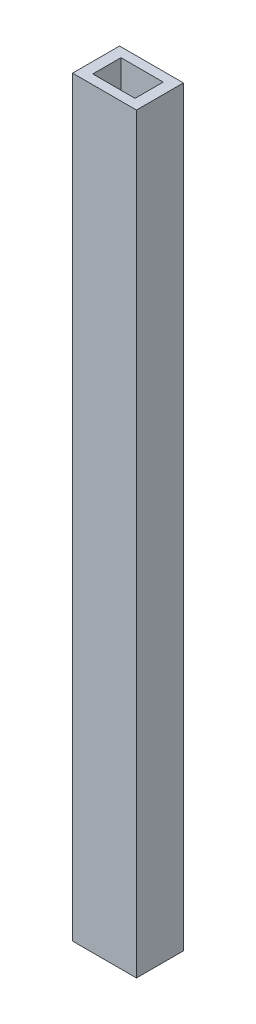
ISO-10303-21;
HEADER;
FILE_DESCRIPTION(('STEP AP214'),'2;1');
FILE_NAME('part.step','',(''),(''),'','','');
FILE_SCHEMA(('AUTOMOTIVE_DESIGN { 1 0 10303 214 1 1 1 1 }'));
ENDSEC;
DATA;
#1=APPLICATION_CONTEXT('core data for automotive mechanical design processes');
#2=APPLICATION_PROTOCOL_DEFINITION('international standard','automotive_design',2000,#1);
#3=PRODUCT_CONTEXT('',#1,'mechanical');
#4=PRODUCT('Part','Part','',(#3));
#5=PRODUCT_RELATED_PRODUCT_CATEGORY('part','',(#4));
#6=PRODUCT_DEFINITION_FORMATION('','',#4);
#7=PRODUCT_DEFINITION_CONTEXT('part definition',#1,'design');
#8=PRODUCT_DEFINITION('design','',#6,#7);
#9=PRODUCT_DEFINITION_SHAPE('','',#8);
#10=(LENGTH_UNIT() NAMED_UNIT(*) SI_UNIT(.MILLI.,.METRE.));
#11=(NAMED_UNIT(*) PLANE_ANGLE_UNIT() SI_UNIT($,.RADIAN.));
#12=(NAMED_UNIT(*) SI_UNIT($,.STERADIAN.) SOLID_ANGLE_UNIT());
#13=UNCERTAINTY_MEASURE_WITH_UNIT(LENGTH_MEASURE(1.E-05),#10,'distance_accuracy_value','');
#14=(GEOMETRIC_REPRESENTATION_CONTEXT(3) GLOBAL_UNCERTAINTY_ASSIGNED_CONTEXT((#13)) GLOBAL_UNIT_ASSIGNED_CONTEXT((#10,
#11,#12)) REPRESENTATION_CONTEXT('',''));
#15=CARTESIAN_POINT('',(0.,0.,0.));
#16=DIRECTION('',(0.,0.,1.));
#17=DIRECTION('',(1.,0.,0.));
#18=AXIS2_PLACEMENT_3D('',#15,#16,#17);
#19=CARTESIAN_POINT('',(0.,203.2,0.));
#20=DIRECTION('',(0.,-1.,0.));
#21=DIRECTION('',(0.,0.,-1.));
#22=AXIS2_PLACEMENT_3D('',#19,#20,#21);
#23=PLANE('',#22);
#24=DIRECTION('',(0.,0.,1.));
#25=VECTOR('',#24,1.);
#26=CARTESIAN_POINT('',(0.,203.2,0.));
#27=LINE('',#26,#25);
#28=CARTESIAN_POINT('',(0.,203.2,-12.7));
#29=VERTEX_POINT('',#28);
#30=CARTESIAN_POINT('',(0.,203.2,0.));
#31=VERTEX_POINT('',#30);
#32=EDGE_CURVE('E153',#29,#31,#27,.T.);
#33=ORIENTED_EDGE('',*,*,#32,.T.);
#34=DIRECTION('',(1.,0.,0.));
#35=VECTOR('',#34,1.);
#36=CARTESIAN_POINT('',(0.,203.2,0.));
#37=LINE('',#36,#35);
#38=CARTESIAN_POINT('',(17.272,203.2,0.));
#39=VERTEX_POINT('',#38);
#40=EDGE_CURVE('E157',#31,#39,#37,.T.);
#41=ORIENTED_EDGE('',*,*,#40,.T.);
#42=DIRECTION('',(0.,0.,-1.));
#43=VECTOR('',#42,1.);
#44=CARTESIAN_POINT('',(17.272,203.2,0.));
#45=LINE('',#44,#43);
#46=CARTESIAN_POINT('',(17.272,203.2,-12.7));
#47=VERTEX_POINT('',#46);
#48=EDGE_CURVE('E161',#39,#47,#45,.T.);
#49=ORIENTED_EDGE('',*,*,#48,.T.);
#50=DIRECTION('',(-1.,0.,0.));
#51=VECTOR('',#50,1.);
#52=CARTESIAN_POINT('',(0.,203.2,-12.7));
#53=LINE('',#52,#51);
#54=EDGE_CURVE('E164',#47,#29,#53,.T.);
#55=ORIENTED_EDGE('',*,*,#54,.T.);
#56=EDGE_LOOP('',(#33,#41,#49,#55));
#57=FACE_BOUND('',#56,.T.);
#58=DIRECTION('',(0.,0.,1.));
#59=VECTOR('',#58,1.);
#60=CARTESIAN_POINT('',(2.921,203.2,-10.16));
#61=LINE('',#60,#59);
#62=CARTESIAN_POINT('',(2.921,203.2,-10.16));
#63=VERTEX_POINT('',#62);
#64=CARTESIAN_POINT('',(2.921,203.2,-2.54));
#65=VERTEX_POINT('',#64);
#66=EDGE_CURVE('E105',#63,#65,#61,.T.);
#67=ORIENTED_EDGE('',*,*,#66,.F.);
#68=DIRECTION('',(-1.,0.,0.));
#69=VECTOR('',#68,1.);
#70=CARTESIAN_POINT('',(2.921,203.2,-10.16));
#71=LINE('',#70,#69);
#72=CARTESIAN_POINT('',(14.351,203.2,-10.16));
#73=VERTEX_POINT('',#72);
#74=EDGE_CURVE('E131',#73,#63,#71,.T.);
#75=ORIENTED_EDGE('',*,*,#74,.F.);
#76=DIRECTION('',(0.,0.,-1.));
#77=VECTOR('',#76,1.);
#78=CARTESIAN_POINT('',(14.351,203.2,-10.16));
#79=LINE('',#78,#77);
#80=CARTESIAN_POINT('',(14.351,203.2,-2.54));
#81=VERTEX_POINT('',#80);
#82=EDGE_CURVE('E127',#81,#73,#79,.T.);
#83=ORIENTED_EDGE('',*,*,#82,.F.);
#84=DIRECTION('',(1.,0.,0.));
#85=VECTOR('',#84,1.);
#86=CARTESIAN_POINT('',(2.921,203.2,-2.54));
#87=LINE('',#86,#85);
#88=EDGE_CURVE('E114',#65,#81,#87,.T.);
#89=ORIENTED_EDGE('',*,*,#88,.F.);
#90=EDGE_LOOP('',(#67,#75,#83,#89));
#91=FACE_BOUND('',#90,.T.);
#92=ADVANCED_FACE('F39',(#57,#91),#23,.F.);
#93=CARTESIAN_POINT('',(0.,0.,0.));
#94=DIRECTION('',(0.,-1.,0.));
#95=DIRECTION('',(0.,0.,-1.));
#96=AXIS2_PLACEMENT_3D('',#93,#94,#95);
#97=PLANE('',#96);
#98=DIRECTION('',(0.,0.,1.));
#99=VECTOR('',#98,1.);
#100=CARTESIAN_POINT('',(0.,0.,0.));
#101=LINE('',#100,#99);
#102=CARTESIAN_POINT('',(0.,0.,-12.7));
#103=VERTEX_POINT('',#102);
#104=CARTESIAN_POINT('',(0.,0.,0.));
#105=VERTEX_POINT('',#104);
#106=EDGE_CURVE('E123',#103,#105,#101,.T.);
#107=ORIENTED_EDGE('',*,*,#106,.F.);
#108=DIRECTION('',(-1.,0.,0.));
#109=VECTOR('',#108,1.);
#110=CARTESIAN_POINT('',(0.,0.,-12.7));
#111=LINE('',#110,#109);
#112=CARTESIAN_POINT('',(17.272,0.,-12.7));
#113=VERTEX_POINT('',#112);
#114=EDGE_CURVE('E158',#113,#103,#111,.T.);
#115=ORIENTED_EDGE('',*,*,#114,.F.);
#116=DIRECTION('',(0.,0.,-1.));
#117=VECTOR('',#116,1.);
#118=CARTESIAN_POINT('',(17.272,0.,0.));
#119=LINE('',#118,#117);
#120=CARTESIAN_POINT('',(17.272,0.,0.));
#121=VERTEX_POINT('',#120);
#122=EDGE_CURVE('E174',#121,#113,#119,.T.);
#123=ORIENTED_EDGE('',*,*,#122,.F.);
#124=DIRECTION('',(1.,0.,0.));
#125=VECTOR('',#124,1.);
#126=CARTESIAN_POINT('',(0.,0.,0.));
#127=LINE('',#126,#125);
#128=EDGE_CURVE('E171',#105,#121,#127,.T.);
#129=ORIENTED_EDGE('',*,*,#128,.F.);
#130=EDGE_LOOP('',(#107,#115,#123,#129));
#131=FACE_BOUND('',#130,.T.);
#132=DIRECTION('',(-1.,0.,0.));
#133=VECTOR('',#132,1.);
#134=CARTESIAN_POINT('',(2.921,0.,-10.16));
#135=LINE('',#134,#133);
#136=CARTESIAN_POINT('',(14.351,0.,-10.16));
#137=VERTEX_POINT('',#136);
#138=CARTESIAN_POINT('',(2.921,0.,-10.16));
#139=VERTEX_POINT('',#138);
#140=EDGE_CURVE('E115',#137,#139,#135,.T.);
#141=ORIENTED_EDGE('',*,*,#140,.T.);
#142=DIRECTION('',(0.,0.,1.));
#143=VECTOR('',#142,1.);
#144=CARTESIAN_POINT('',(2.921,0.,-10.16));
#145=LINE('',#144,#143);
#146=CARTESIAN_POINT('',(2.921,0.,-2.54));
#147=VERTEX_POINT('',#146);
#148=EDGE_CURVE('E63',#139,#147,#145,.T.);
#149=ORIENTED_EDGE('',*,*,#148,.T.);
#150=DIRECTION('',(1.,0.,0.));
#151=VECTOR('',#150,1.);
#152=CARTESIAN_POINT('',(2.921,0.,-2.54));
#153=LINE('',#152,#151);
#154=CARTESIAN_POINT('',(14.351,0.,-2.54));
#155=VERTEX_POINT('',#154);
#156=EDGE_CURVE('E121',#147,#155,#153,.T.);
#157=ORIENTED_EDGE('',*,*,#156,.T.);
#158=DIRECTION('',(0.,0.,-1.));
#159=VECTOR('',#158,1.);
#160=CARTESIAN_POINT('',(14.351,0.,-10.16));
#161=LINE('',#160,#159);
#162=EDGE_CURVE('E140',#155,#137,#161,.T.);
#163=ORIENTED_EDGE('',*,*,#162,.T.);
#164=EDGE_LOOP('',(#141,#149,#157,#163));
#165=FACE_BOUND('',#164,.T.);
#166=ADVANCED_FACE('F197',(#131,#165),#97,.T.);
#167=CARTESIAN_POINT('',(0.,203.2,0.));
#168=DIRECTION('',(1.,0.,0.));
#169=DIRECTION('',(0.,0.,-1.));
#170=AXIS2_PLACEMENT_3D('',#167,#168,#169);
#171=PLANE('',#170);
#172=ORIENTED_EDGE('',*,*,#106,.T.);
#173=DIRECTION('',(0.,-1.,0.));
#174=VECTOR('',#173,1.);
#175=CARTESIAN_POINT('',(0.,203.2,0.));
#176=LINE('',#175,#174);
#177=EDGE_CURVE('E11',#31,#105,#176,.T.);
#178=ORIENTED_EDGE('',*,*,#177,.F.);
#179=ORIENTED_EDGE('',*,*,#32,.F.);
#180=DIRECTION('',(0.,-1.,0.));
#181=VECTOR('',#180,1.);
#182=CARTESIAN_POINT('',(0.,203.2,-12.7));
#183=LINE('',#182,#181);
#184=EDGE_CURVE('E167',#29,#103,#183,.T.);
#185=ORIENTED_EDGE('',*,*,#184,.T.);
#186=EDGE_LOOP('',(#172,#178,#179,#185));
#187=FACE_BOUND('',#186,.T.);
#188=ADVANCED_FACE('F41',(#187),#171,.F.);
#189=CARTESIAN_POINT('',(0.,203.2,0.));
#190=DIRECTION('',(0.,0.,-1.));
#191=DIRECTION('',(-1.,0.,0.));
#192=AXIS2_PLACEMENT_3D('',#189,#190,#191);
#193=PLANE('',#192);
#194=ORIENTED_EDGE('',*,*,#128,.T.);
#195=DIRECTION('',(0.,-1.,0.));
#196=VECTOR('',#195,1.);
#197=CARTESIAN_POINT('',(17.272,203.2,0.));
#198=LINE('',#197,#196);
#199=EDGE_CURVE('E48',#39,#121,#198,.T.);
#200=ORIENTED_EDGE('',*,*,#199,.F.);
#201=ORIENTED_EDGE('',*,*,#40,.F.);
#202=ORIENTED_EDGE('',*,*,#177,.T.);
#203=EDGE_LOOP('',(#194,#200,#201,#202));
#204=FACE_BOUND('',#203,.T.);
#205=ADVANCED_FACE('F207',(#204),#193,.F.);
#206=CARTESIAN_POINT('',(17.272,203.2,0.));
#207=DIRECTION('',(-1.,0.,0.));
#208=DIRECTION('',(0.,0.,1.));
#209=AXIS2_PLACEMENT_3D('',#206,#207,#208);
#210=PLANE('',#209);
#211=ORIENTED_EDGE('',*,*,#122,.T.);
#212=DIRECTION('',(0.,-1.,0.));
#213=VECTOR('',#212,1.);
#214=CARTESIAN_POINT('',(17.272,203.2,-12.7));
#215=LINE('',#214,#213);
#216=EDGE_CURVE('E182',#47,#113,#215,.T.);
#217=ORIENTED_EDGE('',*,*,#216,.F.);
#218=ORIENTED_EDGE('',*,*,#48,.F.);
#219=ORIENTED_EDGE('',*,*,#199,.T.);
#220=EDGE_LOOP('',(#211,#217,#218,#219));
#221=FACE_BOUND('',#220,.T.);
#222=ADVANCED_FACE('F191',(#221),#210,.F.);
#223=CARTESIAN_POINT('',(0.,203.2,-12.7));
#224=DIRECTION('',(0.,0.,1.));
#225=DIRECTION('',(1.,0.,0.));
#226=AXIS2_PLACEMENT_3D('',#223,#224,#225);
#227=PLANE('',#226);
#228=ORIENTED_EDGE('',*,*,#114,.T.);
#229=ORIENTED_EDGE('',*,*,#184,.F.);
#230=ORIENTED_EDGE('',*,*,#54,.F.);
#231=ORIENTED_EDGE('',*,*,#216,.T.);
#232=EDGE_LOOP('',(#228,#229,#230,#231));
#233=FACE_BOUND('',#232,.T.);
#234=ADVANCED_FACE('F201',(#233),#227,.F.);
#235=CARTESIAN_POINT('',(2.921,203.2,-10.16));
#236=DIRECTION('',(1.,0.,0.));
#237=DIRECTION('',(0.,0.,-1.));
#238=AXIS2_PLACEMENT_3D('',#235,#236,#237);
#239=PLANE('',#238);
#240=ORIENTED_EDGE('',*,*,#148,.F.);
#241=DIRECTION('',(0.,-1.,0.));
#242=VECTOR('',#241,1.);
#243=CARTESIAN_POINT('',(2.921,203.2,-10.16));
#244=LINE('',#243,#242);
#245=EDGE_CURVE('E109',#63,#139,#244,.T.);
#246=ORIENTED_EDGE('',*,*,#245,.F.);
#247=ORIENTED_EDGE('',*,*,#66,.T.);
#248=DIRECTION('',(0.,-1.,0.));
#249=VECTOR('',#248,1.);
#250=CARTESIAN_POINT('',(2.921,203.2,-2.54));
#251=LINE('',#250,#249);
#252=EDGE_CURVE('E108',#65,#147,#251,.T.);
#253=ORIENTED_EDGE('',*,*,#252,.T.);
#254=EDGE_LOOP('',(#240,#246,#247,#253));
#255=FACE_BOUND('',#254,.T.);
#256=ADVANCED_FACE('F107',(#255),#239,.T.);
#257=CARTESIAN_POINT('',(2.921,203.2,-2.54));
#258=DIRECTION('',(0.,0.,-1.));
#259=DIRECTION('',(-1.,0.,0.));
#260=AXIS2_PLACEMENT_3D('',#257,#258,#259);
#261=PLANE('',#260);
#262=ORIENTED_EDGE('',*,*,#156,.F.);
#263=ORIENTED_EDGE('',*,*,#252,.F.);
#264=ORIENTED_EDGE('',*,*,#88,.T.);
#265=DIRECTION('',(0.,-1.,0.));
#266=VECTOR('',#265,1.);
#267=CARTESIAN_POINT('',(14.351,203.2,-2.54));
#268=LINE('',#267,#266);
#269=EDGE_CURVE('E124',#81,#155,#268,.T.);
#270=ORIENTED_EDGE('',*,*,#269,.T.);
#271=EDGE_LOOP('',(#262,#263,#264,#270));
#272=FACE_BOUND('',#271,.T.);
#273=ADVANCED_FACE('F118',(#272),#261,.T.);
#274=CARTESIAN_POINT('',(14.351,203.2,-10.16));
#275=DIRECTION('',(-1.,0.,0.));
#276=DIRECTION('',(0.,0.,1.));
#277=AXIS2_PLACEMENT_3D('',#274,#275,#276);
#278=PLANE('',#277);
#279=ORIENTED_EDGE('',*,*,#162,.F.);
#280=ORIENTED_EDGE('',*,*,#269,.F.);
#281=ORIENTED_EDGE('',*,*,#82,.T.);
#282=DIRECTION('',(0.,-1.,0.));
#283=VECTOR('',#282,1.);
#284=CARTESIAN_POINT('',(14.351,203.2,-10.16));
#285=LINE('',#284,#283);
#286=EDGE_CURVE('E55',#73,#137,#285,.T.);
#287=ORIENTED_EDGE('',*,*,#286,.T.);
#288=EDGE_LOOP('',(#279,#280,#281,#287));
#289=FACE_BOUND('',#288,.T.);
#290=ADVANCED_FACE('F230',(#289),#278,.T.);
#291=CARTESIAN_POINT('',(2.921,203.2,-10.16));
#292=DIRECTION('',(0.,0.,1.));
#293=DIRECTION('',(1.,0.,0.));
#294=AXIS2_PLACEMENT_3D('',#291,#292,#293);
#295=PLANE('',#294);
#296=ORIENTED_EDGE('',*,*,#140,.F.);
#297=ORIENTED_EDGE('',*,*,#286,.F.);
#298=ORIENTED_EDGE('',*,*,#74,.T.);
#299=ORIENTED_EDGE('',*,*,#245,.T.);
#300=EDGE_LOOP('',(#296,#297,#298,#299));
#301=FACE_BOUND('',#300,.T.);
#302=ADVANCED_FACE('F234',(#301),#295,.T.);
#303=CLOSED_SHELL('',(#92,#166,#188,#205,#222,#234,#256,#273,#290,#302));
#304=MANIFOLD_SOLID_BREP('B2',#303);
#305=ADVANCED_BREP_SHAPE_REPRESENTATION('',(#18,#304),#14);
#306=SHAPE_DEFINITION_REPRESENTATION(#9,#305);
ENDSEC;
END-ISO-10303-21;
